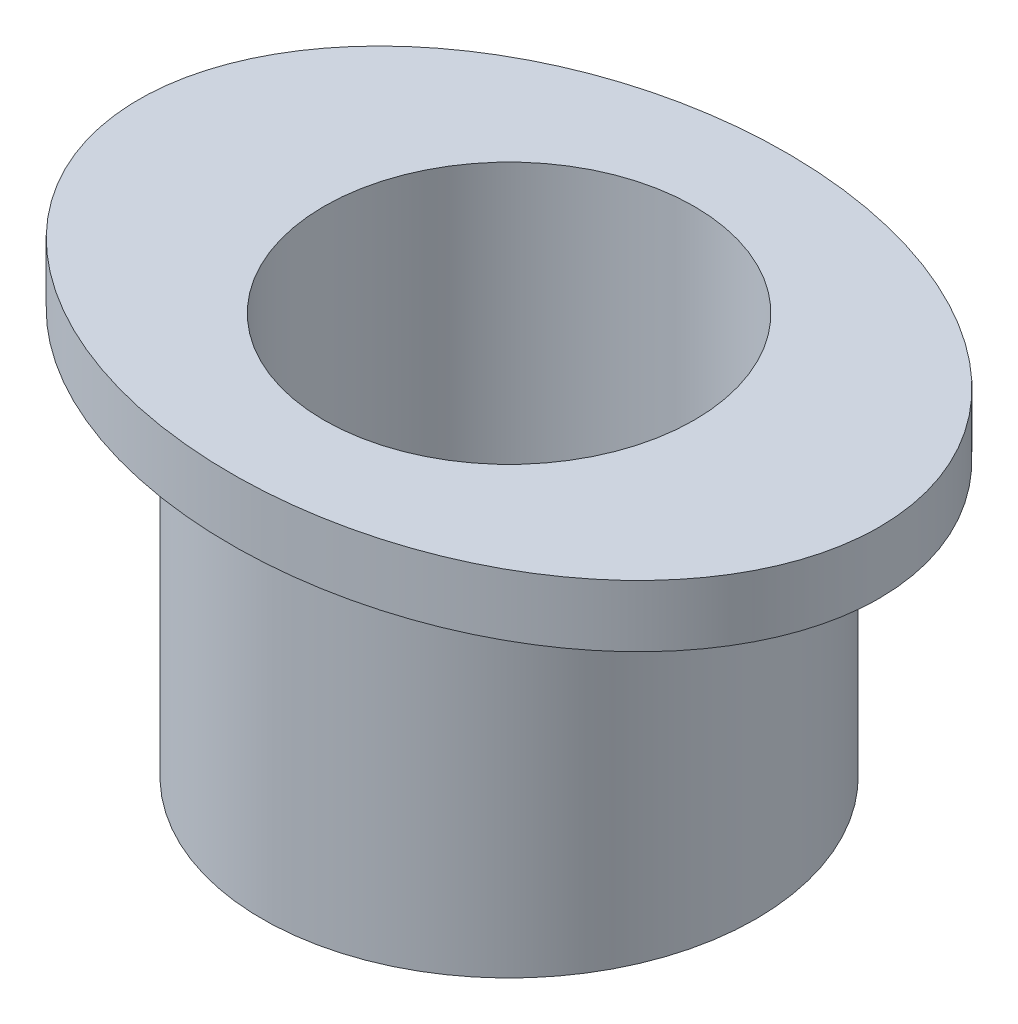
ISO-10303-21;
HEADER;
FILE_DESCRIPTION(('STEP AP214'),'2;1');
FILE_NAME('part.step','',(''),(''),'','','');
FILE_SCHEMA(('AUTOMOTIVE_DESIGN { 1 0 10303 214 1 1 1 1 }'));
ENDSEC;
DATA;
#1=APPLICATION_CONTEXT('core data for automotive mechanical design processes');
#2=APPLICATION_PROTOCOL_DEFINITION('international standard','automotive_design',2000,#1);
#3=PRODUCT_CONTEXT('',#1,'mechanical');
#4=PRODUCT('Part','Part','',(#3));
#5=PRODUCT_RELATED_PRODUCT_CATEGORY('part','',(#4));
#6=PRODUCT_DEFINITION_FORMATION('','',#4);
#7=PRODUCT_DEFINITION_CONTEXT('part definition',#1,'design');
#8=PRODUCT_DEFINITION('design','',#6,#7);
#9=PRODUCT_DEFINITION_SHAPE('','',#8);
#10=(LENGTH_UNIT() NAMED_UNIT(*) SI_UNIT(.MILLI.,.METRE.));
#11=(NAMED_UNIT(*) PLANE_ANGLE_UNIT() SI_UNIT($,.RADIAN.));
#12=(NAMED_UNIT(*) SI_UNIT($,.STERADIAN.) SOLID_ANGLE_UNIT());
#13=UNCERTAINTY_MEASURE_WITH_UNIT(LENGTH_MEASURE(1.E-05),#10,'distance_accuracy_value','');
#14=(GEOMETRIC_REPRESENTATION_CONTEXT(3) GLOBAL_UNCERTAINTY_ASSIGNED_CONTEXT((#13)) GLOBAL_UNIT_ASSIGNED_CONTEXT((#10,
#11,#12)) REPRESENTATION_CONTEXT('',''));
#15=CARTESIAN_POINT('',(0.,0.,0.));
#16=DIRECTION('',(0.,0.,1.));
#17=DIRECTION('',(1.,0.,0.));
#18=AXIS2_PLACEMENT_3D('',#15,#16,#17);
#19=CARTESIAN_POINT('',(0.,-5.5,0.));
#20=DIRECTION('',(0.,1.,0.));
#21=DIRECTION('',(0.,0.,1.));
#22=AXIS2_PLACEMENT_3D('',#19,#20,#21);
#23=CYLINDRICAL_SURFACE('',#22,4.);
#24=CARTESIAN_POINT('',(0.,-5.5,0.));
#25=DIRECTION('',(0.,1.,0.));
#26=DIRECTION('',(1.,0.,0.));
#27=AXIS2_PLACEMENT_3D('',#24,#25,#26);
#28=CIRCLE('',#27,4.);
#29=CARTESIAN_POINT('',(4.,-5.5,0.));
#30=VERTEX_POINT('',#29);
#31=EDGE_CURVE('E11',#30,#30,#28,.T.);
#32=ORIENTED_EDGE('',*,*,#31,.T.);
#33=EDGE_LOOP('',(#32));
#34=FACE_BOUND('',#33,.T.);
#35=CARTESIAN_POINT('',(0.,0.,0.));
#36=DIRECTION('',(0.,1.,0.));
#37=DIRECTION('',(1.,0.,0.));
#38=AXIS2_PLACEMENT_3D('',#35,#36,#37);
#39=CIRCLE('',#38,4.);
#40=CARTESIAN_POINT('',(4.,0.,0.));
#41=VERTEX_POINT('',#40);
#42=EDGE_CURVE('E41',#41,#41,#39,.T.);
#43=ORIENTED_EDGE('',*,*,#42,.F.);
#44=EDGE_LOOP('',(#43));
#45=FACE_BOUND('',#44,.T.);
#46=ADVANCED_FACE('F38',(#34,#45),#23,.T.);
#47=CARTESIAN_POINT('',(0.,-5.5,0.));
#48=DIRECTION('',(0.,1.,0.));
#49=DIRECTION('',(0.,0.,1.));
#50=AXIS2_PLACEMENT_3D('',#47,#48,#49);
#51=PLANE('',#50);
#52=CARTESIAN_POINT('',(0.,-5.5,0.));
#53=DIRECTION('',(0.,1.,0.));
#54=DIRECTION('',(0.,0.,1.));
#55=AXIS2_PLACEMENT_3D('',#52,#53,#54);
#56=CIRCLE('',#55,3.);
#57=CARTESIAN_POINT('',(0.,-5.5,3.));
#58=VERTEX_POINT('',#57);
#59=EDGE_CURVE('E48',#58,#58,#56,.T.);
#60=ORIENTED_EDGE('',*,*,#59,.T.);
#61=EDGE_LOOP('',(#60));
#62=FACE_BOUND('',#61,.T.);
#63=ORIENTED_EDGE('',*,*,#31,.F.);
#64=EDGE_LOOP('',(#63));
#65=FACE_BOUND('',#64,.T.);
#66=ADVANCED_FACE('F71',(#62,#65),#51,.F.);
#67=CARTESIAN_POINT('',(0.,-5.5,0.));
#68=DIRECTION('',(0.,1.,0.));
#69=DIRECTION('',(0.,0.,1.));
#70=AXIS2_PLACEMENT_3D('',#67,#68,#69);
#71=CYLINDRICAL_SURFACE('',#70,3.);
#72=ORIENTED_EDGE('',*,*,#59,.F.);
#73=EDGE_LOOP('',(#72));
#74=FACE_BOUND('',#73,.T.);
#75=CARTESIAN_POINT('',(0.,1.,0.));
#76=DIRECTION('',(0.,1.,0.));
#77=DIRECTION('',(0.,0.,1.));
#78=AXIS2_PLACEMENT_3D('',#75,#76,#77);
#79=CIRCLE('',#78,3.);
#80=CARTESIAN_POINT('',(0.,1.,3.));
#81=VERTEX_POINT('',#80);
#82=EDGE_CURVE('E56',#81,#81,#79,.T.);
#83=ORIENTED_EDGE('',*,*,#82,.T.);
#84=EDGE_LOOP('',(#83));
#85=FACE_BOUND('',#84,.T.);
#86=ADVANCED_FACE('F68',(#74,#85),#71,.F.);
#87=CARTESIAN_POINT('',(0.,1.,0.));
#88=DIRECTION('',(0.,1.,0.));
#89=DIRECTION('',(0.,0.,1.));
#90=AXIS2_PLACEMENT_3D('',#87,#88,#89);
#91=PLANE('',#90);
#92=CARTESIAN_POINT('',(0.,1.,0.));
#93=DIRECTION('',(0.,1.,0.));
#94=DIRECTION('',(1.,0.,0.));
#95=AXIS2_PLACEMENT_3D('',#92,#93,#94);
#96=ELLIPSE('',#95,6.,4.5);
#97=CARTESIAN_POINT('',(6.,1.,0.));
#98=VERTEX_POINT('',#97);
#99=EDGE_CURVE('E52',#98,#98,#96,.T.);
#100=ORIENTED_EDGE('',*,*,#99,.T.);
#101=EDGE_LOOP('',(#100));
#102=FACE_BOUND('',#101,.T.);
#103=ORIENTED_EDGE('',*,*,#82,.F.);
#104=EDGE_LOOP('',(#103));
#105=FACE_BOUND('',#104,.T.);
#106=ADVANCED_FACE('F70',(#102,#105),#91,.T.);
#107=CARTESIAN_POINT('',(0.,0.,0.));
#108=DIRECTION('',(0.,1.,0.));
#109=DIRECTION('',(0.,0.,1.));
#110=AXIS2_PLACEMENT_3D('',#107,#108,#109);
#111=PLANE('',#110);
#112=ORIENTED_EDGE('',*,*,#42,.T.);
#113=EDGE_LOOP('',(#112));
#114=FACE_BOUND('',#113,.T.);
#115=CARTESIAN_POINT('',(0.,0.,0.));
#116=DIRECTION('',(0.,1.,0.));
#117=DIRECTION('',(1.,0.,0.));
#118=AXIS2_PLACEMENT_3D('',#115,#116,#117);
#119=ELLIPSE('',#118,6.,4.5);
#120=CARTESIAN_POINT('',(6.,0.,0.));
#121=VERTEX_POINT('',#120);
#122=EDGE_CURVE('E53',#121,#121,#119,.T.);
#123=ORIENTED_EDGE('',*,*,#122,.F.);
#124=EDGE_LOOP('',(#123));
#125=FACE_BOUND('',#124,.T.);
#126=ADVANCED_FACE('F65',(#114,#125),#111,.F.);
#127=DIRECTION('',(0.,-1.,0.));
#128=VECTOR('',#127,1.);
#129=SURFACE_OF_LINEAR_EXTRUSION('',#96,#128);
#130=ORIENTED_EDGE('',*,*,#99,.F.);
#131=EDGE_LOOP('',(#130));
#132=FACE_BOUND('',#131,.T.);
#133=ORIENTED_EDGE('',*,*,#122,.T.);
#134=EDGE_LOOP('',(#133));
#135=FACE_BOUND('',#134,.T.);
#136=ADVANCED_FACE('F61',(#132,#135),#129,.F.);
#137=CLOSED_SHELL('',(#46,#66,#86,#106,#126,#136));
#138=MANIFOLD_SOLID_BREP('B2',#137);
#139=ADVANCED_BREP_SHAPE_REPRESENTATION('',(#18,#138),#14);
#140=SHAPE_DEFINITION_REPRESENTATION(#9,#139);
ENDSEC;
END-ISO-10303-21;
